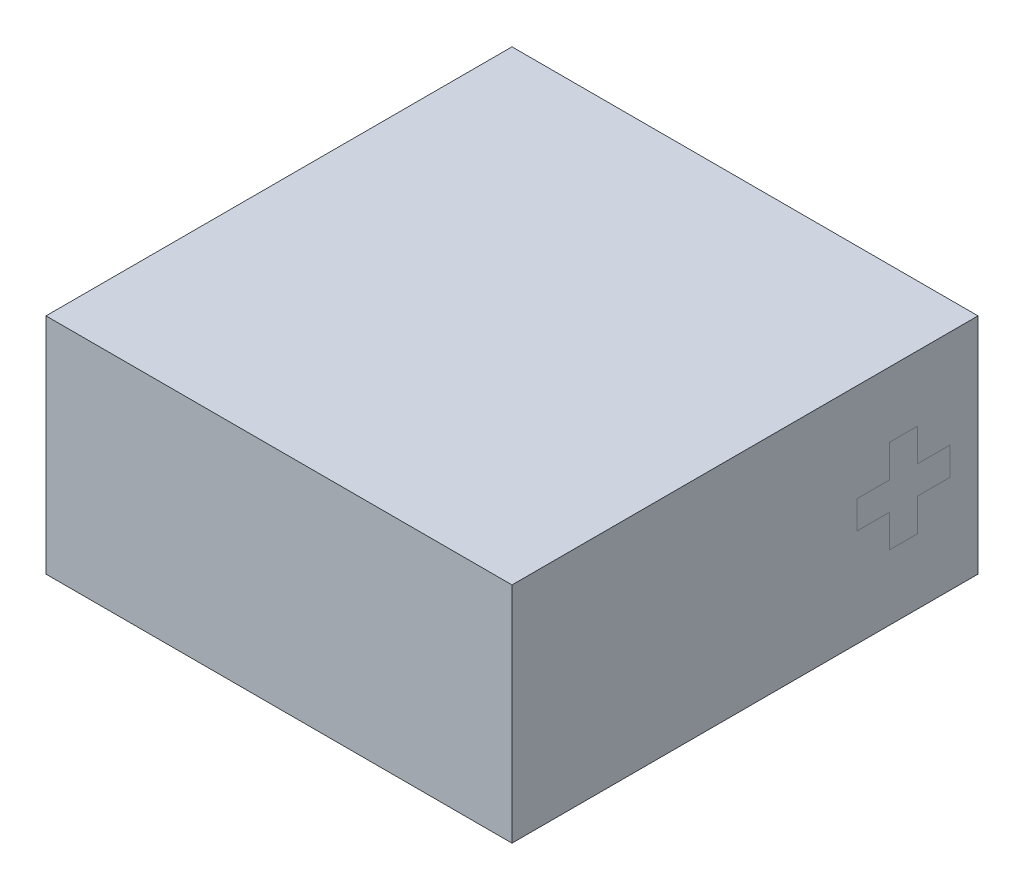
ISO-10303-21;
HEADER;
FILE_DESCRIPTION(('STEP AP214'),'2;1');
FILE_NAME('part.step','',(''),(''),'','','');
FILE_SCHEMA(('AUTOMOTIVE_DESIGN { 1 0 10303 214 1 1 1 1 }'));
ENDSEC;
DATA;
#1=APPLICATION_CONTEXT('core data for automotive mechanical design processes');
#2=APPLICATION_PROTOCOL_DEFINITION('international standard','automotive_design',2000,#1);
#3=PRODUCT_CONTEXT('',#1,'mechanical');
#4=PRODUCT('Part','Part','',(#3));
#5=PRODUCT_RELATED_PRODUCT_CATEGORY('part','',(#4));
#6=PRODUCT_DEFINITION_FORMATION('','',#4);
#7=PRODUCT_DEFINITION_CONTEXT('part definition',#1,'design');
#8=PRODUCT_DEFINITION('design','',#6,#7);
#9=PRODUCT_DEFINITION_SHAPE('','',#8);
#10=(LENGTH_UNIT() NAMED_UNIT(*) SI_UNIT(.MILLI.,.METRE.));
#11=(NAMED_UNIT(*) PLANE_ANGLE_UNIT() SI_UNIT($,.RADIAN.));
#12=(NAMED_UNIT(*) SI_UNIT($,.STERADIAN.) SOLID_ANGLE_UNIT());
#13=UNCERTAINTY_MEASURE_WITH_UNIT(LENGTH_MEASURE(1.E-05),#10,'distance_accuracy_value','');
#14=(GEOMETRIC_REPRESENTATION_CONTEXT(3) GLOBAL_UNCERTAINTY_ASSIGNED_CONTEXT((#13)) GLOBAL_UNIT_ASSIGNED_CONTEXT((#10,
#11,#12)) REPRESENTATION_CONTEXT('',''));
#15=CARTESIAN_POINT('',(0.,0.,0.));
#16=DIRECTION('',(0.,0.,1.));
#17=DIRECTION('',(1.,0.,0.));
#18=AXIS2_PLACEMENT_3D('',#15,#16,#17);
#19=CARTESIAN_POINT('',(2.5,2.4,-2.5));
#20=DIRECTION('',(-1.,0.,0.));
#21=DIRECTION('',(0.,0.,1.));
#22=AXIS2_PLACEMENT_3D('',#19,#20,#21);
#23=PLANE('',#22);
#24=DIRECTION('',(0.,1.,0.));
#25=VECTOR('',#24,1.);
#26=CARTESIAN_POINT('',(2.5,1.35,-2.2));
#27=LINE('',#26,#25);
#28=CARTESIAN_POINT('',(2.5,1.05,-2.2));
#29=VERTEX_POINT('',#28);
#30=CARTESIAN_POINT('',(2.5,1.35,-2.2));
#31=VERTEX_POINT('',#30);
#32=EDGE_CURVE('E445',#29,#31,#27,.T.);
#33=ORIENTED_EDGE('',*,*,#32,.T.);
#34=DIRECTION('',(0.,0.,1.));
#35=VECTOR('',#34,1.);
#36=CARTESIAN_POINT('',(2.5,1.35,-2.2));
#37=LINE('',#36,#35);
#38=CARTESIAN_POINT('',(2.5,1.35,-1.85));
#39=VERTEX_POINT('',#38);
#40=EDGE_CURVE('E13',#31,#39,#37,.T.);
#41=ORIENTED_EDGE('',*,*,#40,.T.);
#42=DIRECTION('',(0.,1.,0.));
#43=VECTOR('',#42,1.);
#44=CARTESIAN_POINT('',(2.5,1.35,-1.85));
#45=LINE('',#44,#43);
#46=CARTESIAN_POINT('',(2.5,1.7,-1.85));
#47=VERTEX_POINT('',#46);
#48=EDGE_CURVE('E357',#39,#47,#45,.T.);
#49=ORIENTED_EDGE('',*,*,#48,.T.);
#50=DIRECTION('',(0.,0.,1.));
#51=VECTOR('',#50,1.);
#52=CARTESIAN_POINT('',(2.5,1.7,-1.85));
#53=LINE('',#52,#51);
#54=CARTESIAN_POINT('',(2.5,1.7,-1.55));
#55=VERTEX_POINT('',#54);
#56=EDGE_CURVE('E477',#47,#55,#53,.T.);
#57=ORIENTED_EDGE('',*,*,#56,.T.);
#58=DIRECTION('',(0.,-1.,0.));
#59=VECTOR('',#58,1.);
#60=CARTESIAN_POINT('',(2.5,1.7,-1.55));
#61=LINE('',#60,#59);
#62=CARTESIAN_POINT('',(2.5,1.35,-1.55));
#63=VERTEX_POINT('',#62);
#64=EDGE_CURVE('E474',#55,#63,#61,.T.);
#65=ORIENTED_EDGE('',*,*,#64,.T.);
#66=DIRECTION('',(0.,0.,1.));
#67=VECTOR('',#66,1.);
#68=CARTESIAN_POINT('',(2.5,1.35,-1.55));
#69=LINE('',#68,#67);
#70=CARTESIAN_POINT('',(2.5,1.35,-1.2));
#71=VERTEX_POINT('',#70);
#72=EDGE_CURVE('E471',#63,#71,#69,.T.);
#73=ORIENTED_EDGE('',*,*,#72,.T.);
#74=DIRECTION('',(0.,-1.,0.));
#75=VECTOR('',#74,1.);
#76=CARTESIAN_POINT('',(2.5,1.35,-1.2));
#77=LINE('',#76,#75);
#78=CARTESIAN_POINT('',(2.5,1.05,-1.2));
#79=VERTEX_POINT('',#78);
#80=EDGE_CURVE('E468',#71,#79,#77,.T.);
#81=ORIENTED_EDGE('',*,*,#80,.T.);
#82=DIRECTION('',(0.,0.,-1.));
#83=VECTOR('',#82,1.);
#84=CARTESIAN_POINT('',(2.5,1.05,-1.2));
#85=LINE('',#84,#83);
#86=CARTESIAN_POINT('',(2.5,1.05,-1.55));
#87=VERTEX_POINT('',#86);
#88=EDGE_CURVE('E465',#79,#87,#85,.T.);
#89=ORIENTED_EDGE('',*,*,#88,.T.);
#90=DIRECTION('',(0.,-1.,0.));
#91=VECTOR('',#90,1.);
#92=CARTESIAN_POINT('',(2.5,1.05,-1.55));
#93=LINE('',#92,#91);
#94=CARTESIAN_POINT('',(2.5,0.7,-1.55));
#95=VERTEX_POINT('',#94);
#96=EDGE_CURVE('E462',#87,#95,#93,.T.);
#97=ORIENTED_EDGE('',*,*,#96,.T.);
#98=DIRECTION('',(0.,0.,-1.));
#99=VECTOR('',#98,1.);
#100=CARTESIAN_POINT('',(2.5,0.7,-1.55));
#101=LINE('',#100,#99);
#102=CARTESIAN_POINT('',(2.5,0.7,-1.85));
#103=VERTEX_POINT('',#102);
#104=EDGE_CURVE('E459',#95,#103,#101,.T.);
#105=ORIENTED_EDGE('',*,*,#104,.T.);
#106=DIRECTION('',(0.,1.,0.));
#107=VECTOR('',#106,1.);
#108=CARTESIAN_POINT('',(2.5,0.7,-1.85));
#109=LINE('',#108,#107);
#110=CARTESIAN_POINT('',(2.5,1.05,-1.85));
#111=VERTEX_POINT('',#110);
#112=EDGE_CURVE('E456',#103,#111,#109,.T.);
#113=ORIENTED_EDGE('',*,*,#112,.T.);
#114=DIRECTION('',(0.,0.,-1.));
#115=VECTOR('',#114,1.);
#116=CARTESIAN_POINT('',(2.5,1.05,-1.85));
#117=LINE('',#116,#115);
#118=EDGE_CURVE('E448',#111,#29,#117,.T.);
#119=ORIENTED_EDGE('',*,*,#118,.T.);
#120=EDGE_LOOP('',(#33,#41,#49,#57,#65,#73,#81,#89,#97,#105,#113,#119));
#121=FACE_BOUND('',#120,.T.);
#122=ADVANCED_FACE('F348',(#121),#23,.F.);
#123=CARTESIAN_POINT('',(-2.5,2.4,-2.5));
#124=DIRECTION('',(1.,0.,0.));
#125=DIRECTION('',(0.,0.,-1.));
#126=AXIS2_PLACEMENT_3D('',#123,#124,#125);
#127=PLANE('',#126);
#128=DIRECTION('',(0.,0.,1.));
#129=VECTOR('',#128,1.);
#130=CARTESIAN_POINT('',(-2.5,0.,-2.5));
#131=LINE('',#130,#129);
#132=CARTESIAN_POINT('',(-2.5,0.,-2.5));
#133=VERTEX_POINT('',#132);
#134=CARTESIAN_POINT('',(-2.5,0.,2.5));
#135=VERTEX_POINT('',#134);
#136=EDGE_CURVE('E444',#133,#135,#131,.T.);
#137=ORIENTED_EDGE('',*,*,#136,.T.);
#138=DIRECTION('',(0.,-1.,0.));
#139=VECTOR('',#138,1.);
#140=CARTESIAN_POINT('',(-2.5,2.4,2.5));
#141=LINE('',#140,#139);
#142=CARTESIAN_POINT('',(-2.5,2.4,2.5));
#143=VERTEX_POINT('',#142);
#144=EDGE_CURVE('E425',#143,#135,#141,.T.);
#145=ORIENTED_EDGE('',*,*,#144,.F.);
#146=DIRECTION('',(0.,0.,1.));
#147=VECTOR('',#146,1.);
#148=CARTESIAN_POINT('',(-2.5,2.4,-2.5));
#149=LINE('',#148,#147);
#150=CARTESIAN_POINT('',(-2.5,2.4,-2.5));
#151=VERTEX_POINT('',#150);
#152=EDGE_CURVE('E432',#151,#143,#149,.T.);
#153=ORIENTED_EDGE('',*,*,#152,.F.);
#154=DIRECTION('',(0.,-1.,0.));
#155=VECTOR('',#154,1.);
#156=CARTESIAN_POINT('',(-2.5,2.4,-2.5));
#157=LINE('',#156,#155);
#158=EDGE_CURVE('E528',#151,#133,#157,.T.);
#159=ORIENTED_EDGE('',*,*,#158,.T.);
#160=EDGE_LOOP('',(#137,#145,#153,#159));
#161=FACE_BOUND('',#160,.T.);
#162=ADVANCED_FACE('F350',(#161),#127,.F.);
#163=CARTESIAN_POINT('',(-2.5,2.4,2.5));
#164=DIRECTION('',(0.,0.,-1.));
#165=DIRECTION('',(-1.,0.,0.));
#166=AXIS2_PLACEMENT_3D('',#163,#164,#165);
#167=PLANE('',#166);
#168=DIRECTION('',(1.,0.,0.));
#169=VECTOR('',#168,1.);
#170=CARTESIAN_POINT('',(-2.5,0.,2.5));
#171=LINE('',#170,#169);
#172=CARTESIAN_POINT('',(2.5,0.,2.5));
#173=VERTEX_POINT('',#172);
#174=EDGE_CURVE('E525',#135,#173,#171,.T.);
#175=ORIENTED_EDGE('',*,*,#174,.T.);
#176=DIRECTION('',(0.,-1.,0.));
#177=VECTOR('',#176,1.);
#178=CARTESIAN_POINT('',(2.5,2.4,2.5));
#179=LINE('',#178,#177);
#180=CARTESIAN_POINT('',(2.5,2.4,2.5));
#181=VERTEX_POINT('',#180);
#182=EDGE_CURVE('E428',#181,#173,#179,.T.);
#183=ORIENTED_EDGE('',*,*,#182,.F.);
#184=DIRECTION('',(1.,0.,0.));
#185=VECTOR('',#184,1.);
#186=CARTESIAN_POINT('',(-2.5,2.4,2.5));
#187=LINE('',#186,#185);
#188=EDGE_CURVE('E421',#143,#181,#187,.T.);
#189=ORIENTED_EDGE('',*,*,#188,.F.);
#190=ORIENTED_EDGE('',*,*,#144,.T.);
#191=EDGE_LOOP('',(#175,#183,#189,#190));
#192=FACE_BOUND('',#191,.T.);
#193=ADVANCED_FACE('F423',(#192),#167,.F.);
#194=ORIENTED_EDGE('',*,*,#40,.F.);
#195=ORIENTED_EDGE('',*,*,#32,.F.);
#196=ORIENTED_EDGE('',*,*,#118,.F.);
#197=ORIENTED_EDGE('',*,*,#112,.F.);
#198=ORIENTED_EDGE('',*,*,#104,.F.);
#199=ORIENTED_EDGE('',*,*,#96,.F.);
#200=ORIENTED_EDGE('',*,*,#88,.F.);
#201=ORIENTED_EDGE('',*,*,#80,.F.);
#202=ORIENTED_EDGE('',*,*,#72,.F.);
#203=ORIENTED_EDGE('',*,*,#64,.F.);
#204=ORIENTED_EDGE('',*,*,#56,.F.);
#205=ORIENTED_EDGE('',*,*,#48,.F.);
#206=EDGE_LOOP('',(#194,#195,#196,#197,#198,#199,#200,#201,#202,#203,#204,#205));
#207=FACE_BOUND('',#206,.T.);
#208=DIRECTION('',(0.,0.,-1.));
#209=VECTOR('',#208,1.);
#210=CARTESIAN_POINT('',(2.5,0.,-2.5));
#211=LINE('',#210,#209);
#212=CARTESIAN_POINT('',(2.5,0.,-2.5));
#213=VERTEX_POINT('',#212);
#214=EDGE_CURVE('E521',#173,#213,#211,.T.);
#215=ORIENTED_EDGE('',*,*,#214,.T.);
#216=DIRECTION('',(0.,-1.,0.));
#217=VECTOR('',#216,1.);
#218=CARTESIAN_POINT('',(2.5,2.4,-2.5));
#219=LINE('',#218,#217);
#220=CARTESIAN_POINT('',(2.5,2.4,-2.5));
#221=VERTEX_POINT('',#220);
#222=EDGE_CURVE('E450',#221,#213,#219,.T.);
#223=ORIENTED_EDGE('',*,*,#222,.F.);
#224=DIRECTION('',(0.,0.,-1.));
#225=VECTOR('',#224,1.);
#226=CARTESIAN_POINT('',(2.5,2.4,-2.5));
#227=LINE('',#226,#225);
#228=EDGE_CURVE('E431',#181,#221,#227,.T.);
#229=ORIENTED_EDGE('',*,*,#228,.F.);
#230=ORIENTED_EDGE('',*,*,#182,.T.);
#231=EDGE_LOOP('',(#215,#223,#229,#230));
#232=FACE_BOUND('',#231,.T.);
#233=ADVANCED_FACE('F507',(#207,#232),#23,.F.);
#234=CARTESIAN_POINT('',(-2.5,2.4,-2.5));
#235=DIRECTION('',(0.,0.,1.));
#236=DIRECTION('',(1.,0.,0.));
#237=AXIS2_PLACEMENT_3D('',#234,#235,#236);
#238=PLANE('',#237);
#239=DIRECTION('',(-1.,0.,0.));
#240=VECTOR('',#239,1.);
#241=CARTESIAN_POINT('',(-2.5,0.,-2.5));
#242=LINE('',#241,#240);
#243=EDGE_CURVE('E441',#213,#133,#242,.T.);
#244=ORIENTED_EDGE('',*,*,#243,.T.);
#245=ORIENTED_EDGE('',*,*,#158,.F.);
#246=DIRECTION('',(-1.,0.,0.));
#247=VECTOR('',#246,1.);
#248=CARTESIAN_POINT('',(-2.5,2.4,-2.5));
#249=LINE('',#248,#247);
#250=EDGE_CURVE('E437',#221,#151,#249,.T.);
#251=ORIENTED_EDGE('',*,*,#250,.F.);
#252=ORIENTED_EDGE('',*,*,#222,.T.);
#253=EDGE_LOOP('',(#244,#245,#251,#252));
#254=FACE_BOUND('',#253,.T.);
#255=ADVANCED_FACE('F517',(#254),#238,.F.);
#256=CARTESIAN_POINT('',(0.,2.4,0.));
#257=DIRECTION('',(0.,1.,0.));
#258=DIRECTION('',(0.,0.,1.));
#259=AXIS2_PLACEMENT_3D('',#256,#257,#258);
#260=PLANE('',#259);
#261=ORIENTED_EDGE('',*,*,#152,.T.);
#262=ORIENTED_EDGE('',*,*,#188,.T.);
#263=ORIENTED_EDGE('',*,*,#228,.T.);
#264=ORIENTED_EDGE('',*,*,#250,.T.);
#265=EDGE_LOOP('',(#261,#262,#263,#264));
#266=FACE_BOUND('',#265,.T.);
#267=ADVANCED_FACE('F435',(#266),#260,.T.);
#268=CARTESIAN_POINT('',(0.,0.,0.));
#269=DIRECTION('',(0.,1.,0.));
#270=DIRECTION('',(0.,0.,1.));
#271=AXIS2_PLACEMENT_3D('',#268,#269,#270);
#272=PLANE('',#271);
#273=ORIENTED_EDGE('',*,*,#136,.F.);
#274=ORIENTED_EDGE('',*,*,#243,.F.);
#275=ORIENTED_EDGE('',*,*,#214,.F.);
#276=ORIENTED_EDGE('',*,*,#174,.F.);
#277=EDGE_LOOP('',(#273,#274,#275,#276));
#278=FACE_BOUND('',#277,.T.);
#279=ADVANCED_FACE('F529',(#278),#272,.F.);
#280=CLOSED_SHELL('',(#122,#162,#193,#233,#255,#267,#279));
#281=MANIFOLD_SOLID_BREP('B2',#280);
#282=ADVANCED_BREP_SHAPE_REPRESENTATION('',(#18,#281),#14);
#283=SHAPE_DEFINITION_REPRESENTATION(#9,#282);
ENDSEC;
END-ISO-10303-21;
